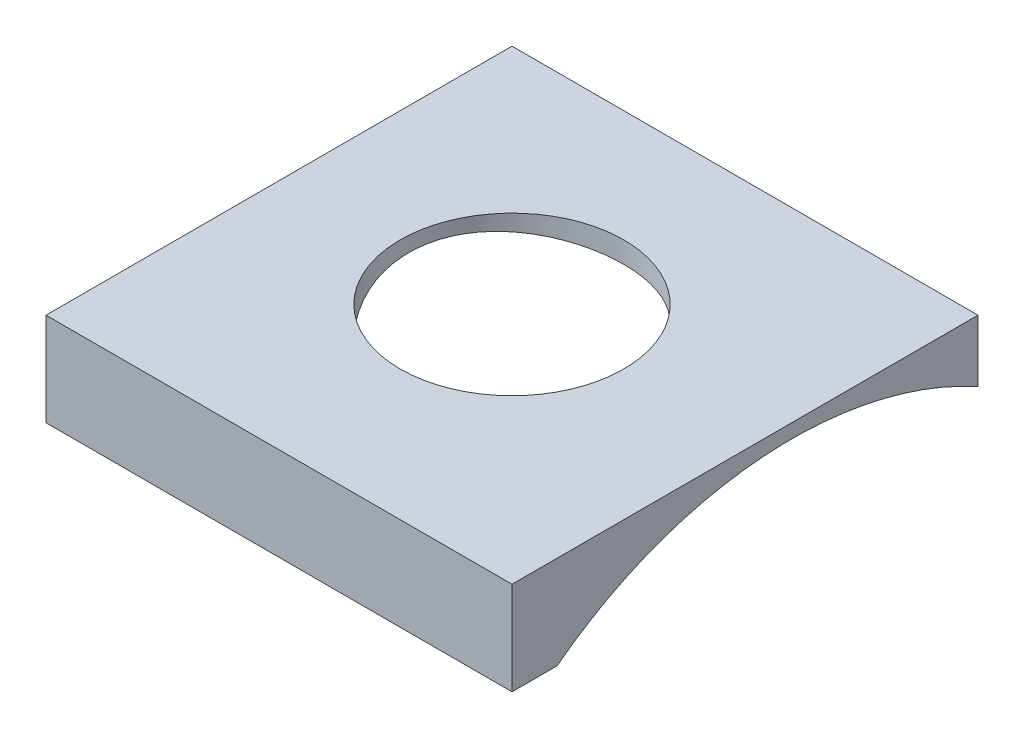
ISO-10303-21;
HEADER;
FILE_DESCRIPTION(('STEP AP214'),'2;1');
FILE_NAME('part.step','',(''),(''),'','','');
FILE_SCHEMA(('AUTOMOTIVE_DESIGN { 1 0 10303 214 1 1 1 1 }'));
ENDSEC;
DATA;
#1=APPLICATION_CONTEXT('core data for automotive mechanical design processes');
#2=APPLICATION_PROTOCOL_DEFINITION('international standard','automotive_design',2000,#1);
#3=PRODUCT_CONTEXT('',#1,'mechanical');
#4=PRODUCT('Part','Part','',(#3));
#5=PRODUCT_RELATED_PRODUCT_CATEGORY('part','',(#4));
#6=PRODUCT_DEFINITION_FORMATION('','',#4);
#7=PRODUCT_DEFINITION_CONTEXT('part definition',#1,'design');
#8=PRODUCT_DEFINITION('design','',#6,#7);
#9=PRODUCT_DEFINITION_SHAPE('','',#8);
#10=(LENGTH_UNIT() NAMED_UNIT(*) SI_UNIT(.MILLI.,.METRE.));
#11=(NAMED_UNIT(*) PLANE_ANGLE_UNIT() SI_UNIT($,.RADIAN.));
#12=(NAMED_UNIT(*) SI_UNIT($,.STERADIAN.) SOLID_ANGLE_UNIT());
#13=UNCERTAINTY_MEASURE_WITH_UNIT(LENGTH_MEASURE(1.E-05),#10,'distance_accuracy_value','');
#14=(GEOMETRIC_REPRESENTATION_CONTEXT(3) GLOBAL_UNCERTAINTY_ASSIGNED_CONTEXT((#13)) GLOBAL_UNIT_ASSIGNED_CONTEXT((#10,
#11,#12)) REPRESENTATION_CONTEXT('',''));
#15=CARTESIAN_POINT('',(0.,0.,0.));
#16=DIRECTION('',(0.,0.,1.));
#17=DIRECTION('',(1.,0.,0.));
#18=AXIS2_PLACEMENT_3D('',#15,#16,#17);
#19=CARTESIAN_POINT('',(0.,-5.,0.));
#20=DIRECTION('',(-1.,0.,0.));
#21=DIRECTION('',(0.,0.,1.));
#22=AXIS2_PLACEMENT_3D('',#19,#20,#21);
#23=PLANE('',#22);
#24=DIRECTION('',(0.,1.,0.));
#25=VECTOR('',#24,1.);
#26=CARTESIAN_POINT('',(0.,-5.,0.));
#27=LINE('',#26,#25);
#28=CARTESIAN_POINT('',(0.,-3.31862216442329,0.));
#29=VERTEX_POINT('',#28);
#30=CARTESIAN_POINT('',(0.,0.,0.));
#31=VERTEX_POINT('',#30);
#32=EDGE_CURVE('E11',#29,#31,#27,.T.);
#33=ORIENTED_EDGE('',*,*,#32,.F.);
#34=CARTESIAN_POINT('',(0.,-21.5,10.));
#35=DIRECTION('',(1.,0.,0.));
#36=DIRECTION('',(0.,0.,-1.));
#37=AXIS2_PLACEMENT_3D('',#34,#35,#36);
#38=CIRCLE('',#37,20.75);
#39=CARTESIAN_POINT('',(0.,-5.,22.5822295321616));
#40=VERTEX_POINT('',#39);
#41=EDGE_CURVE('E84',#29,#40,#38,.T.);
#42=ORIENTED_EDGE('',*,*,#41,.T.);
#43=DIRECTION('',(0.,0.,1.));
#44=VECTOR('',#43,1.);
#45=CARTESIAN_POINT('',(0.,-5.,0.));
#46=LINE('',#45,#44);
#47=CARTESIAN_POINT('',(0.,-5.,25.));
#48=VERTEX_POINT('',#47);
#49=EDGE_CURVE('E109',#40,#48,#46,.T.);
#50=ORIENTED_EDGE('',*,*,#49,.T.);
#51=DIRECTION('',(0.,1.,0.));
#52=VECTOR('',#51,1.);
#53=CARTESIAN_POINT('',(0.,-5.,25.));
#54=LINE('',#53,#52);
#55=CARTESIAN_POINT('',(0.,0.,25.));
#56=VERTEX_POINT('',#55);
#57=EDGE_CURVE('E100',#48,#56,#54,.T.);
#58=ORIENTED_EDGE('',*,*,#57,.T.);
#59=DIRECTION('',(0.,0.,1.));
#60=VECTOR('',#59,1.);
#61=CARTESIAN_POINT('',(0.,0.,0.));
#62=LINE('',#61,#60);
#63=EDGE_CURVE('E119',#31,#56,#62,.T.);
#64=ORIENTED_EDGE('',*,*,#63,.F.);
#65=EDGE_LOOP('',(#33,#42,#50,#58,#64));
#66=FACE_BOUND('',#65,.T.);
#67=ADVANCED_FACE('F30',(#66),#23,.T.);
#68=CARTESIAN_POINT('',(0.,-5.,0.));
#69=DIRECTION('',(0.,0.,-1.));
#70=DIRECTION('',(-1.,0.,0.));
#71=AXIS2_PLACEMENT_3D('',#68,#69,#70);
#72=PLANE('',#71);
#73=DIRECTION('',(0.,1.,0.));
#74=VECTOR('',#73,1.);
#75=CARTESIAN_POINT('',(25.,-5.,0.));
#76=LINE('',#75,#74);
#77=CARTESIAN_POINT('',(25.,-3.31862216442329,0.));
#78=VERTEX_POINT('',#77);
#79=CARTESIAN_POINT('',(25.,0.,0.));
#80=VERTEX_POINT('',#79);
#81=EDGE_CURVE('E42',#78,#80,#76,.T.);
#82=ORIENTED_EDGE('',*,*,#81,.F.);
#83=DIRECTION('',(-1.,0.,0.));
#84=VECTOR('',#83,1.);
#85=CARTESIAN_POINT('',(25.,-3.31862216442329,0.));
#86=LINE('',#85,#84);
#87=EDGE_CURVE('E80',#78,#29,#86,.T.);
#88=ORIENTED_EDGE('',*,*,#87,.T.);
#89=ORIENTED_EDGE('',*,*,#32,.T.);
#90=DIRECTION('',(-1.,0.,0.));
#91=VECTOR('',#90,1.);
#92=CARTESIAN_POINT('',(0.,0.,0.));
#93=LINE('',#92,#91);
#94=EDGE_CURVE('E98',#80,#31,#93,.T.);
#95=ORIENTED_EDGE('',*,*,#94,.F.);
#96=EDGE_LOOP('',(#82,#88,#89,#95));
#97=FACE_BOUND('',#96,.T.);
#98=ADVANCED_FACE('F96',(#97),#72,.T.);
#99=CARTESIAN_POINT('',(25.,-5.,0.));
#100=DIRECTION('',(1.,0.,0.));
#101=DIRECTION('',(0.,0.,-1.));
#102=AXIS2_PLACEMENT_3D('',#99,#100,#101);
#103=PLANE('',#102);
#104=DIRECTION('',(0.,0.,-1.));
#105=VECTOR('',#104,1.);
#106=CARTESIAN_POINT('',(25.,-5.,0.));
#107=LINE('',#106,#105);
#108=CARTESIAN_POINT('',(25.,-5.,25.));
#109=VERTEX_POINT('',#108);
#110=CARTESIAN_POINT('',(25.,-5.,22.5822295321616));
#111=VERTEX_POINT('',#110);
#112=EDGE_CURVE('E93',#109,#111,#107,.T.);
#113=ORIENTED_EDGE('',*,*,#112,.T.);
#114=CARTESIAN_POINT('',(25.,-21.5,10.));
#115=DIRECTION('',(1.,0.,0.));
#116=DIRECTION('',(0.,0.,-1.));
#117=AXIS2_PLACEMENT_3D('',#114,#115,#116);
#118=CIRCLE('',#117,20.75);
#119=EDGE_CURVE('E50',#78,#111,#118,.T.);
#120=ORIENTED_EDGE('',*,*,#119,.F.);
#121=ORIENTED_EDGE('',*,*,#81,.T.);
#122=DIRECTION('',(0.,0.,-1.));
#123=VECTOR('',#122,1.);
#124=CARTESIAN_POINT('',(25.,0.,0.));
#125=LINE('',#124,#123);
#126=CARTESIAN_POINT('',(25.,0.,25.));
#127=VERTEX_POINT('',#126);
#128=EDGE_CURVE('E114',#127,#80,#125,.T.);
#129=ORIENTED_EDGE('',*,*,#128,.F.);
#130=DIRECTION('',(0.,1.,0.));
#131=VECTOR('',#130,1.);
#132=CARTESIAN_POINT('',(25.,-5.,25.));
#133=LINE('',#132,#131);
#134=EDGE_CURVE('E58',#109,#127,#133,.T.);
#135=ORIENTED_EDGE('',*,*,#134,.F.);
#136=EDGE_LOOP('',(#113,#120,#121,#129,#135));
#137=FACE_BOUND('',#136,.T.);
#138=ADVANCED_FACE('F91',(#137),#103,.T.);
#139=CARTESIAN_POINT('',(0.,-5.,25.));
#140=DIRECTION('',(0.,1.,0.));
#141=DIRECTION('',(0.,0.,1.));
#142=AXIS2_PLACEMENT_3D('',#139,#140,#141);
#143=PLANE('',#142);
#144=DIRECTION('',(-1.,0.,0.));
#145=VECTOR('',#144,1.);
#146=CARTESIAN_POINT('',(25.,-5.,22.5822295321616));
#147=LINE('',#146,#145);
#148=EDGE_CURVE('E89',#111,#40,#147,.T.);
#149=ORIENTED_EDGE('',*,*,#148,.F.);
#150=ORIENTED_EDGE('',*,*,#112,.F.);
#151=DIRECTION('',(1.,0.,0.));
#152=VECTOR('',#151,1.);
#153=CARTESIAN_POINT('',(0.,-5.,25.));
#154=LINE('',#153,#152);
#155=EDGE_CURVE('E107',#48,#109,#154,.T.);
#156=ORIENTED_EDGE('',*,*,#155,.F.);
#157=ORIENTED_EDGE('',*,*,#49,.F.);
#158=EDGE_LOOP('',(#149,#150,#156,#157));
#159=FACE_BOUND('',#158,.T.);
#160=ADVANCED_FACE('F128',(#159),#143,.F.);
#161=CARTESIAN_POINT('',(12.,-5.,12.));
#162=DIRECTION('',(0.,1.,0.));
#163=DIRECTION('',(0.,0.,1.));
#164=AXIS2_PLACEMENT_3D('',#161,#162,#163);
#165=CYLINDRICAL_SURFACE('',#164,6.);
#166=CARTESIAN_POINT('',(12.,0.,12.));
#167=DIRECTION('',(0.,1.,0.));
#168=DIRECTION('',(0.,0.,1.));
#169=AXIS2_PLACEMENT_3D('',#166,#167,#168);
#170=CIRCLE('',#169,6.);
#171=CARTESIAN_POINT('',(12.,0.,18.));
#172=VERTEX_POINT('',#171);
#173=EDGE_CURVE('E88',#172,#172,#170,.T.);
#174=ORIENTED_EDGE('',*,*,#173,.T.);
#175=EDGE_LOOP('',(#174));
#176=FACE_BOUND('',#175,.T.);
#177=CARTESIAN_POINT('',(12.,-2.3541780014542,18.));
#178=CARTESIAN_POINT('',(12.1609834147686,-2.35417765087917,17.9999995694146));
#179=CARTESIAN_POINT('',(12.3219740941428,-2.35146420709599,17.9935146469679));
#180=CARTESIAN_POINT('',(12.6427385474647,-2.34068546368145,17.9676445577072));
#181=CARTESIAN_POINT('',(12.8025122483008,-2.33261984503621,17.9482586219341));
#182=CARTESIAN_POINT('',(13.1196824796662,-2.31135785365362,17.8967896020593));
#183=CARTESIAN_POINT('',(13.2770785578415,-2.29816051704262,17.8647041326258));
#184=CARTESIAN_POINT('',(13.5884041776109,-2.26698344708882,17.7881499683294));
#185=CARTESIAN_POINT('',(13.7423323676345,-2.24900188296133,17.7436765326459));
#186=CARTESIAN_POINT('',(14.0451810919603,-2.20878192403124,17.6429270880717));
#187=CARTESIAN_POINT('',(14.1941151582788,-2.18655634882333,17.5866865754308));
#188=CARTESIAN_POINT('',(14.4865860994607,-2.13834682758186,17.4627946677177));
#189=CARTESIAN_POINT('',(14.6301209337064,-2.11236147818699,17.3951390102916));
#190=CARTESIAN_POINT('',(14.9108848145202,-2.05724066188803,17.2489793328625));
#191=CARTESIAN_POINT('',(15.0481153330158,-2.02810593567976,17.1704778624625));
#192=CARTESIAN_POINT('',(15.3155847965711,-1.96731210376464,17.0031803135292));
#193=CARTESIAN_POINT('',(15.4458211798098,-1.93565208350077,16.9143805000281));
#194=CARTESIAN_POINT('',(15.8362980786534,-1.83493889348863,16.6250091979771));
#195=CARTESIAN_POINT('',(16.0837816036751,-1.76268651331826,16.4079649340163));
#196=CARTESIAN_POINT('',(16.5397458526884,-1.61588919099736,15.9367803724949));
#197=CARTESIAN_POINT('',(16.7482155965076,-1.54134361029348,15.6826296672899));
#198=CARTESIAN_POINT('',(17.0327477065618,-1.43017542210723,15.2712744118754));
#199=CARTESIAN_POINT('',(17.1247444543261,-1.39232018721222,15.1251937020017));
#200=CARTESIAN_POINT('',(17.2959568150785,-1.31826860534991,14.8253512374813));
#201=CARTESIAN_POINT('',(17.3751771282331,-1.28207165186225,14.6715923348583));
#202=CARTESIAN_POINT('',(17.520239666329,-1.21201691220769,14.35731339961));
#203=CARTESIAN_POINT('',(17.586077150332,-1.17815995779139,14.1967909952061));
#204=CARTESIAN_POINT('',(17.7037315649959,-1.11343739354645,13.8701758330157));
#205=CARTESIAN_POINT('',(17.7555545999071,-1.08257048512062,13.7040855359738));
#206=CARTESIAN_POINT('',(17.8439516615043,-1.02483898701713,13.3702376054808));
#207=CARTESIAN_POINT('',(17.8807639032566,-0.997916605021999,13.2025530793466));
#208=CARTESIAN_POINT('',(17.9399263399648,-0.947911214858805,12.8641549747577));
#209=CARTESIAN_POINT('',(17.9622824901243,-0.92482662862161,12.6934426734139));
#210=CARTESIAN_POINT('',(17.9922456545297,-0.882803377732171,12.3502320098543));
#211=CARTESIAN_POINT('',(17.9998537474387,-0.863864409962055,12.177733779188));
#212=CARTESIAN_POINT('',(18.000142054054,-0.8303297748289,11.8323043698319));
#213=CARTESIAN_POINT('',(17.9928228667213,-0.815733933223749,11.6593732087916));
#214=CARTESIAN_POINT('',(17.96393089493,-0.791547988749295,11.3227330436569));
#215=CARTESIAN_POINT('',(17.9430565085093,-0.781751875529342,11.1589785131186));
#216=CARTESIAN_POINT('',(17.8878304066078,-0.766107023340391,10.8335069031875));
#217=CARTESIAN_POINT('',(17.8534740999102,-0.760259630940973,10.671790537268));
#218=CARTESIAN_POINT('',(17.7715236632406,-0.752363919019026,10.3517305007527));
#219=CARTESIAN_POINT('',(17.7239353380043,-0.75031393663064,10.1933853839461));
#220=CARTESIAN_POINT('',(17.6158323846834,-0.749752906919367,9.88109961809732));
#221=CARTESIAN_POINT('',(17.5553129482808,-0.751243178099477,9.72716063164631));
#222=CARTESIAN_POINT('',(17.4228152070821,-0.757374414590248,9.42714969460788));
#223=CARTESIAN_POINT('',(17.3510242846152,-0.761967331305368,9.28099391742673));
#224=CARTESIAN_POINT('',(17.1958297087959,-0.773856372597715,8.99503273835627));
#225=CARTESIAN_POINT('',(17.1124218781066,-0.781153471149264,8.85522964492659));
#226=CARTESIAN_POINT('',(16.9346205428579,-0.797990787378794,8.58299174002394));
#227=CARTESIAN_POINT('',(16.8402299444629,-0.807530412337627,8.45055499298021));
#228=CARTESIAN_POINT('',(16.6410521757533,-0.828357741393047,8.19381523375015));
#229=CARTESIAN_POINT('',(16.5362611040282,-0.839646102370313,8.06951530307199));
#230=CARTESIAN_POINT('',(16.314483418074,-0.863713608397307,7.82713135959388));
#231=CARTESIAN_POINT('',(16.1972717944349,-0.876521062878439,7.70925598086896));
#232=CARTESIAN_POINT('',(15.953475323263,-0.902833383761963,7.48362636190878));
#233=CARTESIAN_POINT('',(15.8268870078639,-0.916338507625326,7.3758759000228));
#234=CARTESIAN_POINT('',(15.5652494286362,-0.943456604878773,7.17127696765544));
#235=CARTESIAN_POINT('',(15.4302023456231,-0.957069549686582,7.07442570503532));
#236=CARTESIAN_POINT('',(15.1524624882971,-0.983845702210094,6.89220378988589));
#237=CARTESIAN_POINT('',(15.0097669022585,-0.99700874157976,6.80683740044366));
#238=CARTESIAN_POINT('',(14.7150606327677,-1.0225719022407,6.64677183908005));
#239=CARTESIAN_POINT('',(14.5629282422262,-1.03495394640935,6.57229322178398));
#240=CARTESIAN_POINT('',(14.2528039738435,-1.05817995475904,6.43640461408937));
#241=CARTESIAN_POINT('',(14.094809916068,-1.06902333933612,6.3749995440832));
#242=CARTESIAN_POINT('',(13.6138164004564,-1.09852404248351,6.21121782839354));
#243=CARTESIAN_POINT('',(13.2834456232547,-1.1141850074474,6.12907941686646));
#244=CARTESIAN_POINT('',(12.6171830585415,-1.13473396632879,6.02239234858695));
#245=CARTESIAN_POINT('',(12.2813945644986,-1.13974066627257,5.99720891908281));
#246=CARTESIAN_POINT('',(11.6103179736304,-1.13854746695245,6.00327968098764));
#247=CARTESIAN_POINT('',(11.2750298445492,-1.13234832433464,6.03453006184661));
#248=CARTESIAN_POINT('',(10.6188968906756,-1.1098860684711,6.15172913632767));
#249=CARTESIAN_POINT('',(10.2979237402619,-1.09375001576604,6.23698763129233));
#250=CARTESIAN_POINT('',(9.67478816979961,-1.05406229900392,6.45898872029087));
#251=CARTESIAN_POINT('',(9.37262763307116,-1.03050989392511,6.59573645925718));
#252=CARTESIAN_POINT('',(8.79159311437285,-0.979375001596716,6.91885953471918));
#253=CARTESIAN_POINT('',(8.51305100490154,-0.951746537462601,7.10582420147219));
#254=CARTESIAN_POINT('',(7.99087596214225,-0.897236113935243,7.52353606119367));
#255=CARTESIAN_POINT('',(7.74724630690544,-0.870354224831305,7.75428736071918));
#256=CARTESIAN_POINT('',(7.29888814520677,-0.821828177338626,8.25645066185405));
#257=CARTESIAN_POINT('',(7.09465588996942,-0.80025000046983,8.52831292606443));
#258=CARTESIAN_POINT('',(6.73477329099353,-0.767400600566113,9.1030538431703));
#259=CARTESIAN_POINT('',(6.57911557759751,-0.756127813511488,9.40592778175088));
#260=CARTESIAN_POINT('',(6.3234706496712,-0.747730299124553,10.0281719962231));
#261=CARTESIAN_POINT('',(6.22253424701078,-0.750355230878626,10.3471485455269));
#262=CARTESIAN_POINT('',(6.07507432493383,-0.771415399036806,10.9969081423506));
#263=CARTESIAN_POINT('',(6.02854144007416,-0.789847913253798,11.3276891476533));
#264=CARTESIAN_POINT('',(5.99125271914534,-0.84244294090048,11.9833072998751));
#265=CARTESIAN_POINT('',(5.99922421581896,-0.876229457039819,12.308103656701));
#266=CARTESIAN_POINT('',(6.06694647528169,-0.958267834690034,12.9503549372203));
#267=CARTESIAN_POINT('',(6.12670086559464,-1.00652070945136,13.2678093449917));
#268=CARTESIAN_POINT('',(6.29668658056791,-1.11570496077723,13.8916311592434));
#269=CARTESIAN_POINT('',(6.40763546559703,-1.17680961578523,14.1977718049251));
#270=CARTESIAN_POINT('',(6.67656187943146,-1.30740657248855,14.7867294160028));
#271=CARTESIAN_POINT('',(6.83455147779871,-1.3769010240882,15.0695403717274));
#272=CARTESIAN_POINT('',(7.20173915328245,-1.52292187699199,15.6181147351467));
#273=CARTESIAN_POINT('',(7.41299482184177,-1.59962526382852,15.8824524283263));
#274=CARTESIAN_POINT('',(7.87742870493016,-1.75106743782767,16.3724417303777));
#275=CARTESIAN_POINT('',(8.13062149614532,-1.82580553138172,16.5980798321756));
#276=CARTESIAN_POINT('',(8.54014926981736,-1.9322997165662,16.9050531980055));
#277=CARTESIAN_POINT('',(8.68344685099438,-1.9672310675011,17.0030700122027));
#278=CARTESIAN_POINT('',(8.97850349386133,-2.03400471098421,17.1865878134828));
#279=CARTESIAN_POINT('',(9.13025910158138,-2.06584825014386,17.2720938585684));
#280=CARTESIAN_POINT('',(9.44116770042117,-2.12559298579828,17.4298028438167));
#281=CARTESIAN_POINT('',(9.60031687531337,-2.1534961867229,17.5020125534806));
#282=CARTESIAN_POINT('',(9.92495817599781,-2.20459321777597,17.63247605798));
#283=CARTESIAN_POINT('',(10.0904492494432,-2.22778782523973,17.6907321566842));
#284=CARTESIAN_POINT('',(10.3987855423111,-2.26539701581964,17.7842563827034));
#285=CARTESIAN_POINT('',(10.5408663574866,-2.28062866984284,17.8217309687923));
#286=CARTESIAN_POINT('',(10.8277539432669,-2.30699513014907,17.8862082554931));
#287=CARTESIAN_POINT('',(10.9725604495192,-2.31813033159835,17.9132119661966));
#288=CARTESIAN_POINT('',(11.2640265016038,-2.336050799937,17.9565131535948));
#289=CARTESIAN_POINT('',(11.4106859592158,-2.34283627313015,17.9728111380536));
#290=CARTESIAN_POINT('',(11.7048951191117,-2.35189928265993,17.9945529481839));
#291=CARTESIAN_POINT('',(11.8524445079353,-2.35417832278713,18.0000003946695));
#292=CARTESIAN_POINT('',(12.,-2.3541780014542,18.));
#293=B_SPLINE_CURVE_WITH_KNOTS('',3,(#177,#178,#179,#180,#181,#182,#183,#184,#185,#186,#187,
#188,#189,#190,#191,#192,#193,#194,#195,#196,#197,#198,#199,#200,#201,#202,#203,#204,#205,#206,
#207,#208,#209,#210,#211,#212,#213,#214,#215,#216,#217,#218,#219,#220,#221,#222,#223,#224,#225,
#226,#227,#228,#229,#230,#231,#232,#233,#234,#235,#236,#237,#238,#239,#240,#241,#242,#243,#244,
#245,#246,#247,#248,#249,#250,#251,#252,#253,#254,#255,#256,#257,#258,#259,#260,#261,#262,#263,
#264,#265,#266,#267,#268,#269,#270,#271,#272,#273,#274,#275,#276,#277,#278,#279,#280,#281,#282,
#283,#284,#285,#286,#287,#288,#289,#290,#291,#292),.UNSPECIFIED.,.T.,.F.,(4,2,2,2,2,2,2,2,2,2,2,
2,2,2,2,2,2,2,2,2,2,2,2,2,2,2,2,2,2,2,2,2,2,2,2,2,2,2,2,2,2,2,2,2,2,2,2,2,2,2,2,2,2,2,2,2,2,4),
(0.,0.482810319323676,0.965649418915477,1.44857925242315,1.93169415559094,2.41337219320417,
2.89523048646631,3.37697569797173,3.85889617680558,4.86525591904587,5.87189847006967,
6.4015690046826,6.93104423859927,7.460706716282,7.99013811680647,8.51080592391692,
9.03125910444726,9.55167421794431,10.0720684500635,10.5675755558539,11.0632515513523,
11.5587104415847,12.0543538853891,12.5424924364633,13.0308069731978,13.5189925890004,
14.0073620294423,14.5069604186978,15.0067445104523,15.50640027548,16.0062409997485,
16.5151110745475,17.0241723316998,18.0410780849998,19.0465931998679,20.0520404224151,
21.0448907964515,22.0378404048882,23.0429946951274,24.048243301031,25.0654279855213,
26.082458269144,27.0812317223797,28.0798332136851,29.0551985044937,30.0306321276538,
31.0201736832828,32.0099693515588,33.0462797528222,34.0829511181489,34.6136739590327,
35.1441816365335,35.6744184677913,36.2045676916542,36.6473173829404,37.0900243529616,
37.5327103242273,37.9752485468395),.UNSPECIFIED.);
#294=CARTESIAN_POINT('',(12.,-2.3541780014542,18.));
#295=VERTEX_POINT('',#294);
#296=EDGE_CURVE('E33',#295,#295,#293,.T.);
#297=ORIENTED_EDGE('',*,*,#296,.F.);
#298=EDGE_LOOP('',(#297));
#299=FACE_BOUND('',#298,.T.);
#300=ADVANCED_FACE('F140',(#176,#299),#165,.F.);
#301=CARTESIAN_POINT('',(0.,-5.,25.));
#302=DIRECTION('',(0.,0.,1.));
#303=DIRECTION('',(1.,0.,0.));
#304=AXIS2_PLACEMENT_3D('',#301,#302,#303);
#305=PLANE('',#304);
#306=DIRECTION('',(1.,0.,0.));
#307=VECTOR('',#306,1.);
#308=CARTESIAN_POINT('',(0.,0.,25.));
#309=LINE('',#308,#307);
#310=EDGE_CURVE('E116',#56,#127,#309,.T.);
#311=ORIENTED_EDGE('',*,*,#310,.F.);
#312=ORIENTED_EDGE('',*,*,#57,.F.);
#313=ORIENTED_EDGE('',*,*,#155,.T.);
#314=ORIENTED_EDGE('',*,*,#134,.T.);
#315=EDGE_LOOP('',(#311,#312,#313,#314));
#316=FACE_BOUND('',#315,.T.);
#317=ADVANCED_FACE('F130',(#316),#305,.T.);
#318=CARTESIAN_POINT('',(0.,0.,25.));
#319=DIRECTION('',(0.,1.,0.));
#320=DIRECTION('',(0.,0.,1.));
#321=AXIS2_PLACEMENT_3D('',#318,#319,#320);
#322=PLANE('',#321);
#323=ORIENTED_EDGE('',*,*,#173,.F.);
#324=EDGE_LOOP('',(#323));
#325=FACE_BOUND('',#324,.T.);
#326=ORIENTED_EDGE('',*,*,#63,.T.);
#327=ORIENTED_EDGE('',*,*,#310,.T.);
#328=ORIENTED_EDGE('',*,*,#128,.T.);
#329=ORIENTED_EDGE('',*,*,#94,.T.);
#330=EDGE_LOOP('',(#326,#327,#328,#329));
#331=FACE_BOUND('',#330,.T.);
#332=ADVANCED_FACE('F132',(#325,#331),#322,.T.);
#333=CARTESIAN_POINT('',(25.,-21.5,10.));
#334=DIRECTION('',(-1.,0.,0.));
#335=DIRECTION('',(0.,0.,1.));
#336=AXIS2_PLACEMENT_3D('',#333,#334,#335);
#337=CYLINDRICAL_SURFACE('',#336,20.75);
#338=ORIENTED_EDGE('',*,*,#119,.T.);
#339=ORIENTED_EDGE('',*,*,#148,.T.);
#340=ORIENTED_EDGE('',*,*,#41,.F.);
#341=ORIENTED_EDGE('',*,*,#87,.F.);
#342=EDGE_LOOP('',(#338,#339,#340,#341));
#343=FACE_BOUND('',#342,.T.);
#344=ORIENTED_EDGE('',*,*,#296,.T.);
#345=EDGE_LOOP('',(#344));
#346=FACE_BOUND('',#345,.T.);
#347=ADVANCED_FACE('F81',(#343,#346),#337,.F.);
#348=CLOSED_SHELL('',(#67,#98,#138,#160,#300,#317,#332,#347));
#349=MANIFOLD_SOLID_BREP('B2',#348);
#350=ADVANCED_BREP_SHAPE_REPRESENTATION('',(#18,#349),#14);
#351=SHAPE_DEFINITION_REPRESENTATION(#9,#350);
ENDSEC;
END-ISO-10303-21;
